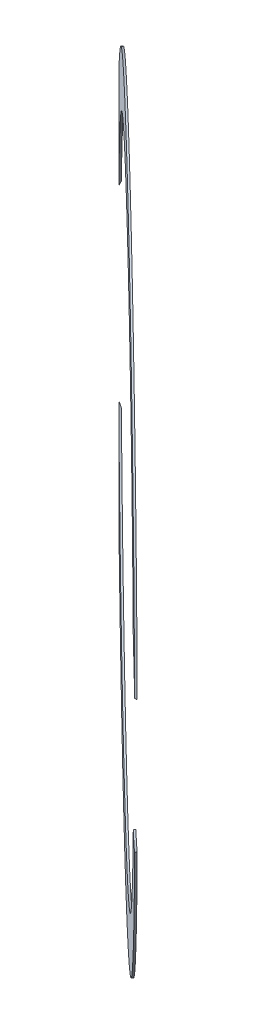
ISO-10303-21;
HEADER;
FILE_DESCRIPTION(('STEP AP214'),'2;1');
FILE_NAME('part.step','',(''),(''),'','','');
FILE_SCHEMA(('AUTOMOTIVE_DESIGN { 1 0 10303 214 1 1 1 1 }'));
ENDSEC;
DATA;
#1=APPLICATION_CONTEXT('core data for automotive mechanical design processes');
#2=APPLICATION_PROTOCOL_DEFINITION('international standard','automotive_design',2000,#1);
#3=PRODUCT_CONTEXT('',#1,'mechanical');
#4=PRODUCT('Part','Part','',(#3));
#5=PRODUCT_RELATED_PRODUCT_CATEGORY('part','',(#4));
#6=PRODUCT_DEFINITION_FORMATION('','',#4);
#7=PRODUCT_DEFINITION_CONTEXT('part definition',#1,'design');
#8=PRODUCT_DEFINITION('design','',#6,#7);
#9=PRODUCT_DEFINITION_SHAPE('','',#8);
#10=(LENGTH_UNIT() NAMED_UNIT(*) SI_UNIT(.MILLI.,.METRE.));
#11=(NAMED_UNIT(*) PLANE_ANGLE_UNIT() SI_UNIT($,.RADIAN.));
#12=(NAMED_UNIT(*) SI_UNIT($,.STERADIAN.) SOLID_ANGLE_UNIT());
#13=UNCERTAINTY_MEASURE_WITH_UNIT(LENGTH_MEASURE(1.E-05),#10,'distance_accuracy_value','');
#14=(GEOMETRIC_REPRESENTATION_CONTEXT(3) GLOBAL_UNCERTAINTY_ASSIGNED_CONTEXT((#13)) GLOBAL_UNIT_ASSIGNED_CONTEXT((#10,
#11,#12)) REPRESENTATION_CONTEXT('',''));
#15=CARTESIAN_POINT('',(0.,0.,0.));
#16=DIRECTION('',(0.,0.,1.));
#17=DIRECTION('',(1.,0.,0.));
#18=AXIS2_PLACEMENT_3D('',#15,#16,#17);
#19=CARTESIAN_POINT('',(-163.082588536067,0.,169.399508697981));
#20=DIRECTION('',(-0.693547097638021,0.,0.720411287639136));
#21=DIRECTION('',(0.720411287639136,0.,0.693547097638021));
#22=AXIS2_PLACEMENT_3D('',#19,#20,#21);
#23=CYLINDRICAL_SURFACE('',#22,298.478991770015);
#24=CARTESIAN_POINT('',(-1.95622657026759,0.,2.03200000000001));
#25=DIRECTION('',(0.,0.,1.));
#26=DIRECTION('',(-1.,0.,0.));
#27=AXIS2_PLACEMENT_3D('',#24,#25,#26);
#28=ELLIPSE('',#27,414.317483486638,298.478991770015);
#29=CARTESIAN_POINT('',(-339.313507627677,173.272082337006,2.03199999999998));
#30=VERTEX_POINT('',#29);
#31=CARTESIAN_POINT('',(-336.932991573868,175.652676961867,2.03199999999998));
#32=VERTEX_POINT('',#31);
#33=EDGE_CURVE('E47',#30,#32,#28,.F.);
#34=ORIENTED_EDGE('',*,*,#33,.F.);
#35=CARTESIAN_POINT('',(-164.227634794267,0.,170.588907733874));
#36=DIRECTION('',(-0.693547097638021,0.,0.720411287639136));
#37=DIRECTION('',(0.720411287639136,0.,0.693547097638021));
#38=AXIS2_PLACEMENT_3D('',#35,#36,#37);
#39=CIRCLE('',#38,298.478991770015);
#40=CARTESIAN_POINT('',(46.3376907785851,60.4918045135721,373.302236800156));
#41=VERTEX_POINT('',#40);
#42=EDGE_CURVE('E94',#41,#30,#39,.T.);
#43=ORIENTED_EDGE('',*,*,#42,.F.);
#44=CARTESIAN_POINT('',(46.3376907785851,60.4918045135722,373.302236800156));
#45=CARTESIAN_POINT('',(46.5545779104486,60.3256785717253,373.126529842284));
#46=CARTESIAN_POINT('',(46.7709346568804,60.1580886472336,372.951586583833));
#47=CARTESIAN_POINT('',(47.2025873788804,59.8199808329609,372.603227465772));
#48=CARTESIAN_POINT('',(47.4178833544486,59.6494629431799,372.429811606163));
#49=CARTESIAN_POINT('',(47.6326489445851,59.4774810707542,372.257159445976));
#50=B_SPLINE_CURVE_WITH_KNOTS('',3,(#44,#45,#46,#47,#48,#49),.UNSPECIFIED.,.F.,.F.,(4,2,4),(0.,
0.974431071834777,1.94886214366928),.UNSPECIFIED.);
#51=CARTESIAN_POINT('',(47.6326489445851,59.4774810707543,372.257159445975));
#52=VERTEX_POINT('',#51);
#53=EDGE_CURVE('E113',#41,#52,#50,.T.);
#54=ORIENTED_EDGE('',*,*,#53,.T.);
#55=CARTESIAN_POINT('',(-163.082588536067,0.,169.399508697981));
#56=DIRECTION('',(-0.693547097638021,0.,0.720411287639136));
#57=DIRECTION('',(0.720411287639136,0.,0.693547097638021));
#58=AXIS2_PLACEMENT_3D('',#55,#56,#57);
#59=CIRCLE('',#58,298.478991770015);
#60=EDGE_CURVE('E97',#52,#32,#59,.T.);
#61=ORIENTED_EDGE('',*,*,#60,.T.);
#62=EDGE_LOOP('',(#34,#43,#54,#61));
#63=FACE_BOUND('',#62,.T.);
#64=ADVANCED_FACE('F38',(#63),#23,.T.);
#65=CARTESIAN_POINT('',(-163.082588536067,0.,169.399508697981));
#66=DIRECTION('',(-0.693547097638021,0.,0.720411287639136));
#67=DIRECTION('',(0.720411287639136,0.,0.693547097638021));
#68=AXIS2_PLACEMENT_3D('',#65,#66,#67);
#69=CYLINDRICAL_SURFACE('',#68,257.203991770015);
#70=CARTESIAN_POINT('',(-164.227634794267,0.,170.588907733874));
#71=DIRECTION('',(-0.693547097638021,0.,0.720411287639136));
#72=DIRECTION('',(0.720411287639136,0.,0.693547097638021));
#73=AXIS2_PLACEMENT_3D('',#70,#71,#72);
#74=CIRCLE('',#73,257.203991770015);
#75=CARTESIAN_POINT('',(12.9939765678766,75.0839301911765,341.201912149368));
#76=VERTEX_POINT('',#75);
#77=CARTESIAN_POINT('',(-339.313507627677,84.1866935553801,2.03200000000001));
#78=VERTEX_POINT('',#77);
#79=EDGE_CURVE('E86',#76,#78,#74,.T.);
#80=ORIENTED_EDGE('',*,*,#79,.T.);
#81=CARTESIAN_POINT('',(-1.95622657026759,0.,2.03200000000001));
#82=DIRECTION('',(0.,0.,1.));
#83=DIRECTION('',(-1.,0.,0.));
#84=AXIS2_PLACEMENT_3D('',#81,#82,#83);
#85=ELLIPSE('',#84,357.02382261791,257.203991770015);
#86=CARTESIAN_POINT('',(-336.932991573868,88.9834129389025,2.03200000000001));
#87=VERTEX_POINT('',#86);
#88=EDGE_CURVE('E73',#78,#87,#85,.F.);
#89=ORIENTED_EDGE('',*,*,#88,.T.);
#90=CARTESIAN_POINT('',(-163.082588536067,0.,169.399508697981));
#91=DIRECTION('',(-0.693547097638021,0.,0.720411287639136));
#92=DIRECTION('',(0.720411287639136,0.,0.693547097638021));
#93=AXIS2_PLACEMENT_3D('',#90,#91,#92);
#94=CIRCLE('',#93,257.203991770015);
#95=CARTESIAN_POINT('',(14.186476661129,74.8677759783423,340.058197391522));
#96=VERTEX_POINT('',#95);
#97=EDGE_CURVE('E79',#96,#87,#94,.T.);
#98=ORIENTED_EDGE('',*,*,#97,.F.);
#99=CARTESIAN_POINT('',(12.9939765678766,75.0839301911766,341.201912149368));
#100=CARTESIAN_POINT('',(13.1925380549164,75.0495711362268,341.010781468004));
#101=CARTESIAN_POINT('',(13.3911938062073,75.0143787576823,340.819906564168));
#102=CARTESIAN_POINT('',(13.7886938372915,74.9423273534042,340.438668311553));
#103=CARTESIAN_POINT('',(13.9875381170847,74.9054683276706,340.248304962773));
#104=CARTESIAN_POINT('',(14.186476661129,74.8677759783423,340.058197391522));
#105=B_SPLINE_CURVE_WITH_KNOTS('',3,(#99,#100,#101,#102,#103,#104),.UNSPECIFIED.,.F.,.F.,(4,2,
4),(0.,0.833200191722822,1.66640038344556),.UNSPECIFIED.);
#106=EDGE_CURVE('E99',#76,#96,#105,.T.);
#107=ORIENTED_EDGE('',*,*,#106,.F.);
#108=EDGE_LOOP('',(#80,#89,#98,#107));
#109=FACE_BOUND('',#108,.T.);
#110=ADVANCED_FACE('F83',(#109),#69,.F.);
#111=CARTESIAN_POINT('',(-163.082588536067,0.,169.399508697981));
#112=DIRECTION('',(-0.693547097638021,0.,0.720411287639136));
#113=DIRECTION('',(0.720411287639136,0.,0.693547097638021));
#114=AXIS2_PLACEMENT_3D('',#111,#112,#113);
#115=PLANE('',#114);
#116=ORIENTED_EDGE('',*,*,#97,.T.);
#117=DIRECTION('',(0.,1.,0.));
#118=VECTOR('',#117,1.);
#119=CARTESIAN_POINT('',(-336.932991573868,0.,2.03200000000001));
#120=LINE('',#119,#118);
#121=EDGE_CURVE('E71',#87,#32,#120,.T.);
#122=ORIENTED_EDGE('',*,*,#121,.T.);
#123=ORIENTED_EDGE('',*,*,#60,.F.);
#124=CARTESIAN_POINT('',(0.,0.,326.400735490448));
#125=DIRECTION('',(-0.693547097638021,0.,0.720411287639136));
#126=DIRECTION('',(-0.720411287639136,0.,-0.693547097638021));
#127=AXIS2_PLACEMENT_3D('',#124,#125,#126);
#128=ELLIPSE('',#127,105.772912373035,76.2);
#129=EDGE_CURVE('E90',#96,#52,#128,.F.);
#130=ORIENTED_EDGE('',*,*,#129,.F.);
#131=EDGE_LOOP('',(#116,#122,#123,#130));
#132=FACE_BOUND('',#131,.T.);
#133=ADVANCED_FACE('F89',(#132),#115,.F.);
#134=CARTESIAN_POINT('',(-164.227634794267,0.,170.588907733874));
#135=DIRECTION('',(-0.693547097638021,0.,0.720411287639136));
#136=DIRECTION('',(0.720411287639136,0.,0.693547097638021));
#137=AXIS2_PLACEMENT_3D('',#134,#135,#136);
#138=PLANE('',#137);
#139=DIRECTION('',(0.,1.,0.));
#140=VECTOR('',#139,1.);
#141=CARTESIAN_POINT('',(-339.313507627677,0.,2.03200000000001));
#142=LINE('',#141,#140);
#143=EDGE_CURVE('E12',#78,#30,#142,.T.);
#144=ORIENTED_EDGE('',*,*,#143,.F.);
#145=ORIENTED_EDGE('',*,*,#79,.F.);
#146=CARTESIAN_POINT('',(0.,0.,328.692481925197));
#147=DIRECTION('',(-0.693547097638021,0.,0.720411287639136));
#148=DIRECTION('',(-0.720411287639136,0.,-0.693547097638021));
#149=AXIS2_PLACEMENT_3D('',#146,#147,#148);
#150=ELLIPSE('',#149,105.772912373035,76.2);
#151=EDGE_CURVE('E78',#76,#41,#150,.F.);
#152=ORIENTED_EDGE('',*,*,#151,.T.);
#153=ORIENTED_EDGE('',*,*,#42,.T.);
#154=EDGE_LOOP('',(#144,#145,#152,#153));
#155=FACE_BOUND('',#154,.T.);
#156=ADVANCED_FACE('F122',(#155),#138,.T.);
#157=CARTESIAN_POINT('',(0.,0.,377.59814618189));
#158=DIRECTION('',(0.,0.,-1.));
#159=DIRECTION('',(-1.,0.,0.));
#160=AXIS2_PLACEMENT_3D('',#157,#158,#159);
#161=CYLINDRICAL_SURFACE('',#160,76.2);
#162=ORIENTED_EDGE('',*,*,#151,.F.);
#163=ORIENTED_EDGE('',*,*,#106,.T.);
#164=ORIENTED_EDGE('',*,*,#129,.T.);
#165=ORIENTED_EDGE('',*,*,#53,.F.);
#166=EDGE_LOOP('',(#162,#163,#164,#165));
#167=FACE_BOUND('',#166,.T.);
#168=ADVANCED_FACE('F119',(#167),#161,.F.);
#169=CARTESIAN_POINT('',(0.,0.,2.032));
#170=DIRECTION('',(0.,0.,1.));
#171=DIRECTION('',(1.,0.,0.));
#172=AXIS2_PLACEMENT_3D('',#169,#170,#171);
#173=PLANE('',#172);
#174=ORIENTED_EDGE('',*,*,#33,.T.);
#175=ORIENTED_EDGE('',*,*,#121,.F.);
#176=ORIENTED_EDGE('',*,*,#88,.F.);
#177=ORIENTED_EDGE('',*,*,#143,.T.);
#178=EDGE_LOOP('',(#174,#175,#176,#177));
#179=FACE_BOUND('',#178,.T.);
#180=ADVANCED_FACE('F40',(#179),#173,.F.);
#181=CLOSED_SHELL('',(#64,#110,#133,#156,#168,#180));
#182=MANIFOLD_SOLID_BREP('B2',#181);
#183=CARTESIAN_POINT('',(0.,0.,377.59814618189));
#184=DIRECTION('',(0.,0.,-1.));
#185=DIRECTION('',(-1.,0.,0.));
#186=AXIS2_PLACEMENT_3D('',#183,#184,#185);
#187=CYLINDRICAL_SURFACE('',#186,76.2);
#188=CARTESIAN_POINT('',(0.,0.,326.400735490448));
#189=DIRECTION('',(-0.693547097638021,0.,0.720411287639136));
#190=DIRECTION('',(-0.720411287639136,0.,-0.693547097638021));
#191=AXIS2_PLACEMENT_3D('',#188,#189,#190);
#192=ELLIPSE('',#191,105.772912373035,76.2);
#193=CARTESIAN_POINT('',(47.6326489445851,-59.4774810707543,372.257159445975));
#194=VERTEX_POINT('',#193);
#195=CARTESIAN_POINT('',(14.186476661129,-74.8677759783423,340.058197391522));
#196=VERTEX_POINT('',#195);
#197=EDGE_CURVE('E237',#194,#196,#192,.F.);
#198=ORIENTED_EDGE('',*,*,#197,.T.);
#199=CARTESIAN_POINT('',(14.186476661129,-74.8677759783423,340.058197391522));
#200=CARTESIAN_POINT('',(13.9875381170847,-74.9054683276706,340.248304962773));
#201=CARTESIAN_POINT('',(13.7886938372915,-74.9423273534042,340.438668311553));
#202=CARTESIAN_POINT('',(13.3911938062073,-75.0143787576823,340.819906564168));
#203=CARTESIAN_POINT('',(13.1925380549164,-75.0495711362268,341.010781468004));
#204=CARTESIAN_POINT('',(12.9939765678766,-75.0839301911766,341.201912149368));
#205=B_SPLINE_CURVE_WITH_KNOTS('',3,(#199,#200,#201,#202,#203,#204),.UNSPECIFIED.,.F.,.F.,(4,2,
4),(0.,0.833200191722811,1.66640038344561),.UNSPECIFIED.);
#206=CARTESIAN_POINT('',(12.9939765678766,-75.0839301911766,341.201912149368));
#207=VERTEX_POINT('',#206);
#208=EDGE_CURVE('E168',#196,#207,#205,.T.);
#209=ORIENTED_EDGE('',*,*,#208,.T.);
#210=CARTESIAN_POINT('',(0.,0.,328.692481925197));
#211=DIRECTION('',(-0.693547097638021,0.,0.720411287639136));
#212=DIRECTION('',(-0.720411287639136,0.,-0.693547097638021));
#213=AXIS2_PLACEMENT_3D('',#210,#211,#212);
#214=ELLIPSE('',#213,105.772912373035,76.2);
#215=CARTESIAN_POINT('',(46.3376907785851,-60.4918045135721,373.302236800156));
#216=VERTEX_POINT('',#215);
#217=EDGE_CURVE('E239',#216,#207,#214,.F.);
#218=ORIENTED_EDGE('',*,*,#217,.F.);
#219=CARTESIAN_POINT('',(47.6326489445851,-59.4774810707542,372.257159445975));
#220=CARTESIAN_POINT('',(47.4178833544486,-59.6494629431799,372.429811606163));
#221=CARTESIAN_POINT('',(47.2025873788804,-59.8199808329609,372.603227465772));
#222=CARTESIAN_POINT('',(46.7709346568804,-60.1580886472336,372.951586583833));
#223=CARTESIAN_POINT('',(46.5545779104486,-60.3256785717252,373.126529842284));
#224=CARTESIAN_POINT('',(46.3376907785851,-60.4918045135722,373.302236800156));
#225=B_SPLINE_CURVE_WITH_KNOTS('',3,(#219,#220,#221,#222,#223,#224),.UNSPECIFIED.,.F.,.F.,(4,2,
4),(0.,0.97443107183449,1.94886214366927),.UNSPECIFIED.);
#226=EDGE_CURVE('E216',#194,#216,#225,.T.);
#227=ORIENTED_EDGE('',*,*,#226,.F.);
#228=EDGE_LOOP('',(#198,#209,#218,#227));
#229=FACE_BOUND('',#228,.T.);
#230=ADVANCED_FACE('F159',(#229),#187,.F.);
#231=CARTESIAN_POINT('',(-163.082588536067,0.,169.399508697981));
#232=DIRECTION('',(-0.693547097638021,0.,0.720411287639136));
#233=DIRECTION('',(0.720411287639136,0.,0.693547097638021));
#234=AXIS2_PLACEMENT_3D('',#231,#232,#233);
#235=CYLINDRICAL_SURFACE('',#234,257.203991770015);
#236=CARTESIAN_POINT('',(-163.082588536067,0.,169.399508697981));
#237=DIRECTION('',(-0.693547097638021,0.,0.720411287639136));
#238=DIRECTION('',(0.720411287639136,0.,0.693547097638021));
#239=AXIS2_PLACEMENT_3D('',#236,#237,#238);
#240=CIRCLE('',#239,257.203991770015);
#241=CARTESIAN_POINT('',(-336.932991573868,-88.9834129389025,2.03200000000001));
#242=VERTEX_POINT('',#241);
#243=EDGE_CURVE('E182',#242,#196,#240,.T.);
#244=ORIENTED_EDGE('',*,*,#243,.F.);
#245=CARTESIAN_POINT('',(-1.95622657026759,0.,2.03200000000001));
#246=DIRECTION('',(0.,0.,1.));
#247=DIRECTION('',(-1.,0.,0.));
#248=AXIS2_PLACEMENT_3D('',#245,#246,#247);
#249=ELLIPSE('',#248,357.02382261791,257.203991770015);
#250=CARTESIAN_POINT('',(-339.313507627677,-84.1866935553801,2.03200000000001));
#251=VERTEX_POINT('',#250);
#252=EDGE_CURVE('E36',#242,#251,#249,.F.);
#253=ORIENTED_EDGE('',*,*,#252,.T.);
#254=CARTESIAN_POINT('',(-164.227634794267,0.,170.588907733874));
#255=DIRECTION('',(-0.693547097638021,0.,0.720411287639136));
#256=DIRECTION('',(0.720411287639136,0.,0.693547097638021));
#257=AXIS2_PLACEMENT_3D('',#254,#255,#256);
#258=CIRCLE('',#257,257.203991770015);
#259=EDGE_CURVE('E213',#251,#207,#258,.T.);
#260=ORIENTED_EDGE('',*,*,#259,.T.);
#261=ORIENTED_EDGE('',*,*,#208,.F.);
#262=EDGE_LOOP('',(#244,#253,#260,#261));
#263=FACE_BOUND('',#262,.T.);
#264=ADVANCED_FACE('F210',(#263),#235,.F.);
#265=CARTESIAN_POINT('',(-164.227634794267,0.,170.588907733874));
#266=DIRECTION('',(-0.693547097638021,0.,0.720411287639136));
#267=DIRECTION('',(0.720411287639136,0.,0.693547097638021));
#268=AXIS2_PLACEMENT_3D('',#265,#266,#267);
#269=PLANE('',#268);
#270=DIRECTION('',(0.,1.,0.));
#271=VECTOR('',#270,1.);
#272=CARTESIAN_POINT('',(-339.313507627677,0.,2.03200000000001));
#273=LINE('',#272,#271);
#274=CARTESIAN_POINT('',(-339.313507627677,-173.272082337006,2.03199999999998));
#275=VERTEX_POINT('',#274);
#276=EDGE_CURVE('E175',#275,#251,#273,.T.);
#277=ORIENTED_EDGE('',*,*,#276,.F.);
#278=CARTESIAN_POINT('',(-164.227634794267,0.,170.588907733874));
#279=DIRECTION('',(-0.693547097638021,0.,0.720411287639136));
#280=DIRECTION('',(0.720411287639136,0.,0.693547097638021));
#281=AXIS2_PLACEMENT_3D('',#278,#279,#280);
#282=CIRCLE('',#281,298.478991770015);
#283=EDGE_CURVE('E212',#275,#216,#282,.T.);
#284=ORIENTED_EDGE('',*,*,#283,.T.);
#285=ORIENTED_EDGE('',*,*,#217,.T.);
#286=ORIENTED_EDGE('',*,*,#259,.F.);
#287=EDGE_LOOP('',(#277,#284,#285,#286));
#288=FACE_BOUND('',#287,.T.);
#289=ADVANCED_FACE('F246',(#288),#269,.T.);
#290=CARTESIAN_POINT('',(-163.082588536067,0.,169.399508697981));
#291=DIRECTION('',(-0.693547097638021,0.,0.720411287639136));
#292=DIRECTION('',(0.720411287639136,0.,0.693547097638021));
#293=AXIS2_PLACEMENT_3D('',#290,#291,#292);
#294=PLANE('',#293);
#295=CARTESIAN_POINT('',(-163.082588536067,0.,169.399508697981));
#296=DIRECTION('',(-0.693547097638021,0.,0.720411287639136));
#297=DIRECTION('',(0.720411287639136,0.,0.693547097638021));
#298=AXIS2_PLACEMENT_3D('',#295,#296,#297);
#299=CIRCLE('',#298,298.478991770015);
#300=CARTESIAN_POINT('',(-336.932991573868,-175.652676961867,2.03199999999998));
#301=VERTEX_POINT('',#300);
#302=EDGE_CURVE('E206',#301,#194,#299,.T.);
#303=ORIENTED_EDGE('',*,*,#302,.F.);
#304=DIRECTION('',(0.,1.,0.));
#305=VECTOR('',#304,1.);
#306=CARTESIAN_POINT('',(-336.932991573868,0.,2.03200000000001));
#307=LINE('',#306,#305);
#308=EDGE_CURVE('E200',#301,#242,#307,.T.);
#309=ORIENTED_EDGE('',*,*,#308,.T.);
#310=ORIENTED_EDGE('',*,*,#243,.T.);
#311=ORIENTED_EDGE('',*,*,#197,.F.);
#312=EDGE_LOOP('',(#303,#309,#310,#311));
#313=FACE_BOUND('',#312,.T.);
#314=ADVANCED_FACE('F205',(#313),#294,.F.);
#315=CARTESIAN_POINT('',(-163.082588536067,0.,169.399508697981));
#316=DIRECTION('',(-0.693547097638021,0.,0.720411287639136));
#317=DIRECTION('',(0.720411287639136,0.,0.693547097638021));
#318=AXIS2_PLACEMENT_3D('',#315,#316,#317);
#319=CYLINDRICAL_SURFACE('',#318,298.478991770015);
#320=CARTESIAN_POINT('',(-1.95622657026759,0.,2.03200000000001));
#321=DIRECTION('',(0.,0.,1.));
#322=DIRECTION('',(-1.,0.,0.));
#323=AXIS2_PLACEMENT_3D('',#320,#321,#322);
#324=ELLIPSE('',#323,414.317483486638,298.478991770015);
#325=EDGE_CURVE('E207',#301,#275,#324,.F.);
#326=ORIENTED_EDGE('',*,*,#325,.F.);
#327=ORIENTED_EDGE('',*,*,#302,.T.);
#328=ORIENTED_EDGE('',*,*,#226,.T.);
#329=ORIENTED_EDGE('',*,*,#283,.F.);
#330=EDGE_LOOP('',(#326,#327,#328,#329));
#331=FACE_BOUND('',#330,.T.);
#332=ADVANCED_FACE('F161',(#331),#319,.T.);
#333=CARTESIAN_POINT('',(0.,0.,2.032));
#334=DIRECTION('',(0.,0.,1.));
#335=DIRECTION('',(1.,0.,0.));
#336=AXIS2_PLACEMENT_3D('',#333,#334,#335);
#337=PLANE('',#336);
#338=ORIENTED_EDGE('',*,*,#325,.T.);
#339=ORIENTED_EDGE('',*,*,#276,.T.);
#340=ORIENTED_EDGE('',*,*,#252,.F.);
#341=ORIENTED_EDGE('',*,*,#308,.F.);
#342=EDGE_LOOP('',(#338,#339,#340,#341));
#343=FACE_BOUND('',#342,.T.);
#344=ADVANCED_FACE('F199',(#343),#337,.F.);
#345=CLOSED_SHELL('',(#230,#264,#289,#314,#332,#344));
#346=MANIFOLD_SOLID_BREP('B6',#345);
#347=ADVANCED_BREP_SHAPE_REPRESENTATION('',(#18,#182,#346),#14);
#348=SHAPE_DEFINITION_REPRESENTATION(#9,#347);
ENDSEC;
END-ISO-10303-21;
